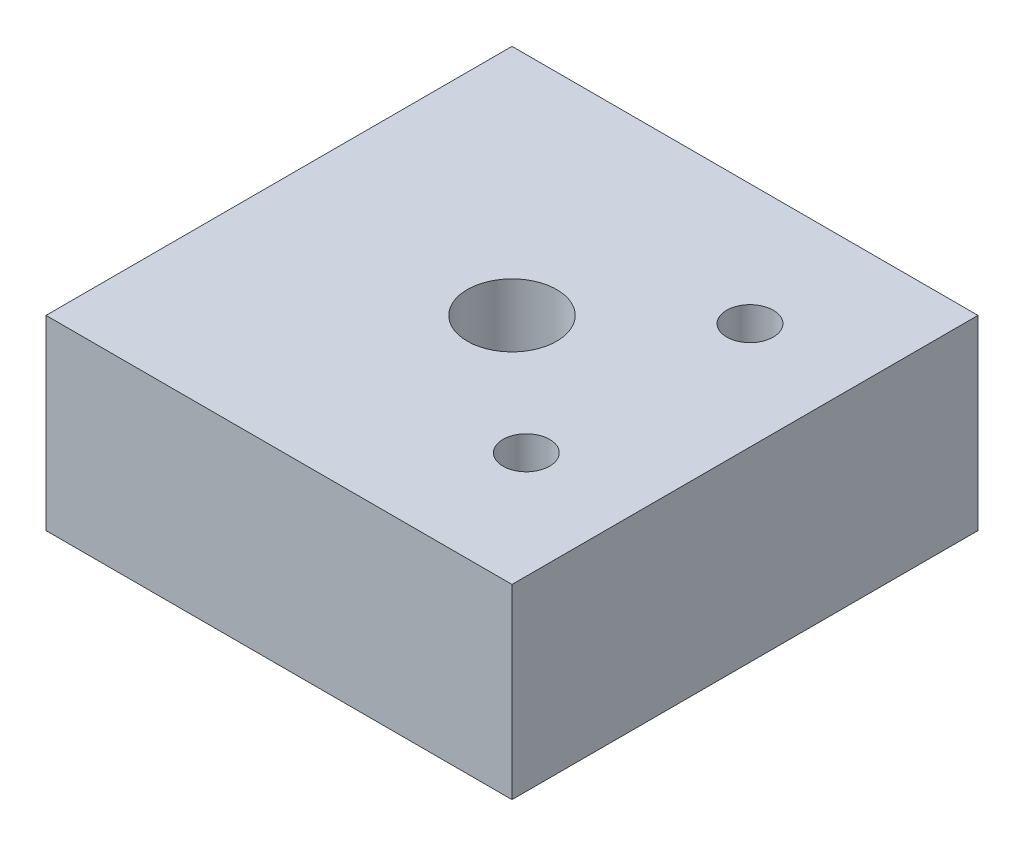
ISO-10303-21;
HEADER;
FILE_DESCRIPTION(('STEP AP214'),'2;1');
FILE_NAME('part.step','',(''),(''),'','','');
FILE_SCHEMA(('AUTOMOTIVE_DESIGN { 1 0 10303 214 1 1 1 1 }'));
ENDSEC;
DATA;
#1=APPLICATION_CONTEXT('core data for automotive mechanical design processes');
#2=APPLICATION_PROTOCOL_DEFINITION('international standard','automotive_design',2000,#1);
#3=PRODUCT_CONTEXT('',#1,'mechanical');
#4=PRODUCT('Part','Part','',(#3));
#5=PRODUCT_RELATED_PRODUCT_CATEGORY('part','',(#4));
#6=PRODUCT_DEFINITION_FORMATION('','',#4);
#7=PRODUCT_DEFINITION_CONTEXT('part definition',#1,'design');
#8=PRODUCT_DEFINITION('design','',#6,#7);
#9=PRODUCT_DEFINITION_SHAPE('','',#8);
#10=(LENGTH_UNIT() NAMED_UNIT(*) SI_UNIT(.MILLI.,.METRE.));
#11=(NAMED_UNIT(*) PLANE_ANGLE_UNIT() SI_UNIT($,.RADIAN.));
#12=(NAMED_UNIT(*) SI_UNIT($,.STERADIAN.) SOLID_ANGLE_UNIT());
#13=UNCERTAINTY_MEASURE_WITH_UNIT(LENGTH_MEASURE(1.E-05),#10,'distance_accuracy_value','');
#14=(GEOMETRIC_REPRESENTATION_CONTEXT(3) GLOBAL_UNCERTAINTY_ASSIGNED_CONTEXT((#13)) GLOBAL_UNIT_ASSIGNED_CONTEXT((#10,
#11,#12)) REPRESENTATION_CONTEXT('',''));
#15=CARTESIAN_POINT('',(0.,0.,0.));
#16=DIRECTION('',(0.,0.,1.));
#17=DIRECTION('',(1.,0.,0.));
#18=AXIS2_PLACEMENT_3D('',#15,#16,#17);
#19=CARTESIAN_POINT('',(0.,200.,0.));
#20=DIRECTION('',(0.,-1.,0.));
#21=DIRECTION('',(0.,0.,-1.));
#22=AXIS2_PLACEMENT_3D('',#19,#20,#21);
#23=PLANE('',#22);
#24=DIRECTION('',(0.,0.,-1.));
#25=VECTOR('',#24,1.);
#26=CARTESIAN_POINT('',(250.,200.,250.));
#27=LINE('',#26,#25);
#28=CARTESIAN_POINT('',(250.,200.,250.));
#29=VERTEX_POINT('',#28);
#30=CARTESIAN_POINT('',(250.,200.,-250.));
#31=VERTEX_POINT('',#30);
#32=EDGE_CURVE('E98',#29,#31,#27,.T.);
#33=ORIENTED_EDGE('',*,*,#32,.T.);
#34=DIRECTION('',(-1.,0.,0.));
#35=VECTOR('',#34,1.);
#36=CARTESIAN_POINT('',(-250.,200.,-250.));
#37=LINE('',#36,#35);
#38=CARTESIAN_POINT('',(-250.,200.,-250.));
#39=VERTEX_POINT('',#38);
#40=EDGE_CURVE('E93',#31,#39,#37,.T.);
#41=ORIENTED_EDGE('',*,*,#40,.T.);
#42=DIRECTION('',(0.,0.,1.));
#43=VECTOR('',#42,1.);
#44=CARTESIAN_POINT('',(-250.,200.,250.));
#45=LINE('',#44,#43);
#46=CARTESIAN_POINT('',(-250.,200.,250.));
#47=VERTEX_POINT('',#46);
#48=EDGE_CURVE('E96',#39,#47,#45,.T.);
#49=ORIENTED_EDGE('',*,*,#48,.T.);
#50=DIRECTION('',(1.,0.,0.));
#51=VECTOR('',#50,1.);
#52=CARTESIAN_POINT('',(-250.,200.,250.));
#53=LINE('',#52,#51);
#54=EDGE_CURVE('E63',#47,#29,#53,.T.);
#55=ORIENTED_EDGE('',*,*,#54,.T.);
#56=EDGE_LOOP('',(#33,#41,#49,#55));
#57=FACE_BOUND('',#56,.T.);
#58=CARTESIAN_POINT('',(0.,200.,0.));
#59=DIRECTION('',(0.,1.,0.));
#60=DIRECTION('',(0.,0.,1.));
#61=AXIS2_PLACEMENT_3D('',#58,#59,#60);
#62=CIRCLE('',#61,48.0193926927952);
#63=CARTESIAN_POINT('',(0.,200.,48.0193926927952));
#64=VERTEX_POINT('',#63);
#65=EDGE_CURVE('E118',#64,#64,#62,.T.);
#66=ORIENTED_EDGE('',*,*,#65,.F.);
#67=EDGE_LOOP('',(#66));
#68=FACE_BOUND('',#67,.T.);
#69=CARTESIAN_POINT('',(135.356868742165,200.,-120.));
#70=DIRECTION('',(0.,1.,0.));
#71=DIRECTION('',(0.,0.,1.));
#72=AXIS2_PLACEMENT_3D('',#69,#70,#71);
#73=CIRCLE('',#72,25.);
#74=CARTESIAN_POINT('',(135.356868742165,200.,-95.));
#75=VERTEX_POINT('',#74);
#76=EDGE_CURVE('E140',#75,#75,#73,.T.);
#77=ORIENTED_EDGE('',*,*,#76,.F.);
#78=EDGE_LOOP('',(#77));
#79=FACE_BOUND('',#78,.T.);
#80=CARTESIAN_POINT('',(135.356868742165,200.,120.));
#81=DIRECTION('',(0.,1.,0.));
#82=DIRECTION('',(0.,0.,1.));
#83=AXIS2_PLACEMENT_3D('',#80,#81,#82);
#84=CIRCLE('',#83,25.);
#85=CARTESIAN_POINT('',(135.356868742165,200.,145.));
#86=VERTEX_POINT('',#85);
#87=EDGE_CURVE('E148',#86,#86,#84,.T.);
#88=ORIENTED_EDGE('',*,*,#87,.F.);
#89=EDGE_LOOP('',(#88));
#90=FACE_BOUND('',#89,.T.);
#91=ADVANCED_FACE('F45',(#57,#68,#79,#90),#23,.F.);
#92=CARTESIAN_POINT('',(0.,0.,0.));
#93=DIRECTION('',(0.,-1.,0.));
#94=DIRECTION('',(0.,0.,-1.));
#95=AXIS2_PLACEMENT_3D('',#92,#93,#94);
#96=PLANE('',#95);
#97=CARTESIAN_POINT('',(135.356868742165,0.,-120.));
#98=DIRECTION('',(0.,1.,0.));
#99=DIRECTION('',(0.,0.,1.));
#100=AXIS2_PLACEMENT_3D('',#97,#98,#99);
#101=CIRCLE('',#100,25.);
#102=CARTESIAN_POINT('',(135.356868742165,0.,-95.));
#103=VERTEX_POINT('',#102);
#104=EDGE_CURVE('E144',#103,#103,#101,.T.);
#105=ORIENTED_EDGE('',*,*,#104,.T.);
#106=EDGE_LOOP('',(#105));
#107=FACE_BOUND('',#106,.T.);
#108=DIRECTION('',(0.,0.,-1.));
#109=VECTOR('',#108,1.);
#110=CARTESIAN_POINT('',(250.,0.,250.));
#111=LINE('',#110,#109);
#112=CARTESIAN_POINT('',(250.,0.,250.));
#113=VERTEX_POINT('',#112);
#114=CARTESIAN_POINT('',(250.,0.,-250.));
#115=VERTEX_POINT('',#114);
#116=EDGE_CURVE('E114',#113,#115,#111,.T.);
#117=ORIENTED_EDGE('',*,*,#116,.F.);
#118=DIRECTION('',(1.,0.,0.));
#119=VECTOR('',#118,1.);
#120=CARTESIAN_POINT('',(-250.,0.,250.));
#121=LINE('',#120,#119);
#122=CARTESIAN_POINT('',(-250.,0.,250.));
#123=VERTEX_POINT('',#122);
#124=EDGE_CURVE('E86',#123,#113,#121,.T.);
#125=ORIENTED_EDGE('',*,*,#124,.F.);
#126=DIRECTION('',(0.,0.,1.));
#127=VECTOR('',#126,1.);
#128=CARTESIAN_POINT('',(-250.,0.,250.));
#129=LINE('',#128,#127);
#130=CARTESIAN_POINT('',(-250.,0.,-250.));
#131=VERTEX_POINT('',#130);
#132=EDGE_CURVE('E80',#131,#123,#129,.T.);
#133=ORIENTED_EDGE('',*,*,#132,.F.);
#134=DIRECTION('',(-1.,0.,0.));
#135=VECTOR('',#134,1.);
#136=CARTESIAN_POINT('',(-250.,0.,-250.));
#137=LINE('',#136,#135);
#138=EDGE_CURVE('E103',#115,#131,#137,.T.);
#139=ORIENTED_EDGE('',*,*,#138,.F.);
#140=EDGE_LOOP('',(#117,#125,#133,#139));
#141=FACE_BOUND('',#140,.T.);
#142=CARTESIAN_POINT('',(0.,0.,0.));
#143=DIRECTION('',(0.,1.,0.));
#144=DIRECTION('',(0.,0.,1.));
#145=AXIS2_PLACEMENT_3D('',#142,#143,#144);
#146=CIRCLE('',#145,48.0193926927952);
#147=CARTESIAN_POINT('',(0.,0.,48.0193926927952));
#148=VERTEX_POINT('',#147);
#149=EDGE_CURVE('E136',#148,#148,#146,.T.);
#150=ORIENTED_EDGE('',*,*,#149,.T.);
#151=EDGE_LOOP('',(#150));
#152=FACE_BOUND('',#151,.T.);
#153=CARTESIAN_POINT('',(135.356868742165,0.,120.));
#154=DIRECTION('',(0.,1.,0.));
#155=DIRECTION('',(0.,0.,1.));
#156=AXIS2_PLACEMENT_3D('',#153,#154,#155);
#157=CIRCLE('',#156,25.);
#158=CARTESIAN_POINT('',(135.356868742165,0.,145.));
#159=VERTEX_POINT('',#158);
#160=EDGE_CURVE('E152',#159,#159,#157,.T.);
#161=ORIENTED_EDGE('',*,*,#160,.T.);
#162=EDGE_LOOP('',(#161));
#163=FACE_BOUND('',#162,.T.);
#164=ADVANCED_FACE('F131',(#107,#141,#152,#163),#96,.T.);
#165=CARTESIAN_POINT('',(250.,200.,250.));
#166=DIRECTION('',(-1.,0.,0.));
#167=DIRECTION('',(0.,0.,1.));
#168=AXIS2_PLACEMENT_3D('',#165,#166,#167);
#169=PLANE('',#168);
#170=ORIENTED_EDGE('',*,*,#116,.T.);
#171=DIRECTION('',(0.,-1.,0.));
#172=VECTOR('',#171,1.);
#173=CARTESIAN_POINT('',(250.,200.,-250.));
#174=LINE('',#173,#172);
#175=EDGE_CURVE('E11',#31,#115,#174,.T.);
#176=ORIENTED_EDGE('',*,*,#175,.F.);
#177=ORIENTED_EDGE('',*,*,#32,.F.);
#178=DIRECTION('',(0.,-1.,0.));
#179=VECTOR('',#178,1.);
#180=CARTESIAN_POINT('',(250.,200.,250.));
#181=LINE('',#180,#179);
#182=EDGE_CURVE('E110',#29,#113,#181,.T.);
#183=ORIENTED_EDGE('',*,*,#182,.T.);
#184=EDGE_LOOP('',(#170,#176,#177,#183));
#185=FACE_BOUND('',#184,.T.);
#186=ADVANCED_FACE('F47',(#185),#169,.F.);
#187=CARTESIAN_POINT('',(-250.,200.,-250.));
#188=DIRECTION('',(0.,0.,1.));
#189=DIRECTION('',(1.,0.,0.));
#190=AXIS2_PLACEMENT_3D('',#187,#188,#189);
#191=PLANE('',#190);
#192=ORIENTED_EDGE('',*,*,#138,.T.);
#193=DIRECTION('',(0.,-1.,0.));
#194=VECTOR('',#193,1.);
#195=CARTESIAN_POINT('',(-250.,200.,-250.));
#196=LINE('',#195,#194);
#197=EDGE_CURVE('E55',#39,#131,#196,.T.);
#198=ORIENTED_EDGE('',*,*,#197,.F.);
#199=ORIENTED_EDGE('',*,*,#40,.F.);
#200=ORIENTED_EDGE('',*,*,#175,.T.);
#201=EDGE_LOOP('',(#192,#198,#199,#200));
#202=FACE_BOUND('',#201,.T.);
#203=ADVANCED_FACE('F102',(#202),#191,.F.);
#204=CARTESIAN_POINT('',(-250.,200.,250.));
#205=DIRECTION('',(1.,0.,0.));
#206=DIRECTION('',(0.,0.,-1.));
#207=AXIS2_PLACEMENT_3D('',#204,#205,#206);
#208=PLANE('',#207);
#209=ORIENTED_EDGE('',*,*,#132,.T.);
#210=DIRECTION('',(0.,-1.,0.));
#211=VECTOR('',#210,1.);
#212=CARTESIAN_POINT('',(-250.,200.,250.));
#213=LINE('',#212,#211);
#214=EDGE_CURVE('E105',#47,#123,#213,.T.);
#215=ORIENTED_EDGE('',*,*,#214,.F.);
#216=ORIENTED_EDGE('',*,*,#48,.F.);
#217=ORIENTED_EDGE('',*,*,#197,.T.);
#218=EDGE_LOOP('',(#209,#215,#216,#217));
#219=FACE_BOUND('',#218,.T.);
#220=ADVANCED_FACE('F106',(#219),#208,.F.);
#221=CARTESIAN_POINT('',(-250.,200.,250.));
#222=DIRECTION('',(0.,0.,-1.));
#223=DIRECTION('',(-1.,0.,0.));
#224=AXIS2_PLACEMENT_3D('',#221,#222,#223);
#225=PLANE('',#224);
#226=ORIENTED_EDGE('',*,*,#124,.T.);
#227=ORIENTED_EDGE('',*,*,#182,.F.);
#228=ORIENTED_EDGE('',*,*,#54,.F.);
#229=ORIENTED_EDGE('',*,*,#214,.T.);
#230=EDGE_LOOP('',(#226,#227,#228,#229));
#231=FACE_BOUND('',#230,.T.);
#232=ADVANCED_FACE('F128',(#231),#225,.F.);
#233=CARTESIAN_POINT('',(0.,200.,0.));
#234=DIRECTION('',(0.,-1.,0.));
#235=DIRECTION('',(0.,0.,-1.));
#236=AXIS2_PLACEMENT_3D('',#233,#234,#235);
#237=CYLINDRICAL_SURFACE('',#236,48.0193926927952);
#238=ORIENTED_EDGE('',*,*,#65,.T.);
#239=EDGE_LOOP('',(#238));
#240=FACE_BOUND('',#239,.T.);
#241=ORIENTED_EDGE('',*,*,#149,.F.);
#242=EDGE_LOOP('',(#241));
#243=FACE_BOUND('',#242,.T.);
#244=ADVANCED_FACE('F171',(#240,#243),#237,.F.);
#245=CARTESIAN_POINT('',(135.356868742165,200.,-120.));
#246=DIRECTION('',(0.,-1.,0.));
#247=DIRECTION('',(0.,0.,-1.));
#248=AXIS2_PLACEMENT_3D('',#245,#246,#247);
#249=CYLINDRICAL_SURFACE('',#248,25.);
#250=ORIENTED_EDGE('',*,*,#76,.T.);
#251=EDGE_LOOP('',(#250));
#252=FACE_BOUND('',#251,.T.);
#253=ORIENTED_EDGE('',*,*,#104,.F.);
#254=EDGE_LOOP('',(#253));
#255=FACE_BOUND('',#254,.T.);
#256=ADVANCED_FACE('F216',(#252,#255),#249,.F.);
#257=CARTESIAN_POINT('',(135.356868742165,200.,120.));
#258=DIRECTION('',(0.,-1.,0.));
#259=DIRECTION('',(0.,0.,-1.));
#260=AXIS2_PLACEMENT_3D('',#257,#258,#259);
#261=CYLINDRICAL_SURFACE('',#260,25.);
#262=ORIENTED_EDGE('',*,*,#87,.T.);
#263=EDGE_LOOP('',(#262));
#264=FACE_BOUND('',#263,.T.);
#265=ORIENTED_EDGE('',*,*,#160,.F.);
#266=EDGE_LOOP('',(#265));
#267=FACE_BOUND('',#266,.T.);
#268=ADVANCED_FACE('F160',(#264,#267),#261,.F.);
#269=CLOSED_SHELL('',(#91,#164,#186,#203,#220,#232,#244,#256,#268));
#270=MANIFOLD_SOLID_BREP('B2',#269);
#271=ADVANCED_BREP_SHAPE_REPRESENTATION('',(#18,#270),#14);
#272=SHAPE_DEFINITION_REPRESENTATION(#9,#271);
ENDSEC;
END-ISO-10303-21;
